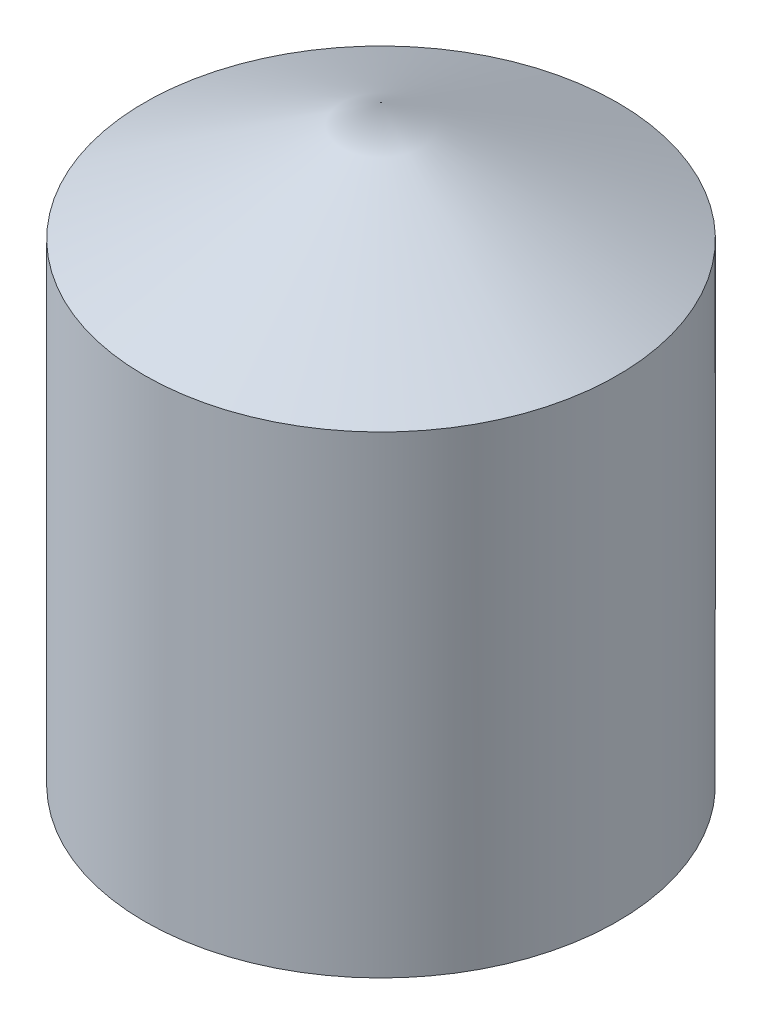
ISO-10303-21;
HEADER;
FILE_DESCRIPTION(('STEP AP214'),'2;1');
FILE_NAME('part.step','',(''),(''),'','','');
FILE_SCHEMA(('AUTOMOTIVE_DESIGN { 1 0 10303 214 1 1 1 1 }'));
ENDSEC;
DATA;
#1=APPLICATION_CONTEXT('core data for automotive mechanical design processes');
#2=APPLICATION_PROTOCOL_DEFINITION('international standard','automotive_design',2000,#1);
#3=PRODUCT_CONTEXT('',#1,'mechanical');
#4=PRODUCT('Part','Part','',(#3));
#5=PRODUCT_RELATED_PRODUCT_CATEGORY('part','',(#4));
#6=PRODUCT_DEFINITION_FORMATION('','',#4);
#7=PRODUCT_DEFINITION_CONTEXT('part definition',#1,'design');
#8=PRODUCT_DEFINITION('design','',#6,#7);
#9=PRODUCT_DEFINITION_SHAPE('','',#8);
#10=(LENGTH_UNIT() NAMED_UNIT(*) SI_UNIT(.MILLI.,.METRE.));
#11=(NAMED_UNIT(*) PLANE_ANGLE_UNIT() SI_UNIT($,.RADIAN.));
#12=(NAMED_UNIT(*) SI_UNIT($,.STERADIAN.) SOLID_ANGLE_UNIT());
#13=UNCERTAINTY_MEASURE_WITH_UNIT(LENGTH_MEASURE(1.E-05),#10,'distance_accuracy_value','');
#14=(GEOMETRIC_REPRESENTATION_CONTEXT(3) GLOBAL_UNCERTAINTY_ASSIGNED_CONTEXT((#13)) GLOBAL_UNIT_ASSIGNED_CONTEXT((#10,
#11,#12)) REPRESENTATION_CONTEXT('',''));
#15=CARTESIAN_POINT('',(0.,0.,0.));
#16=DIRECTION('',(0.,0.,1.));
#17=DIRECTION('',(1.,0.,0.));
#18=AXIS2_PLACEMENT_3D('',#15,#16,#17);
#19=CARTESIAN_POINT('',(0.,50.8,0.));
#20=DIRECTION('',(0.,-1.,0.));
#21=DIRECTION('',(0.,0.,-1.));
#22=AXIS2_PLACEMENT_3D('',#19,#20,#21);
#23=CYLINDRICAL_SURFACE('',#22,25.4);
#24=CARTESIAN_POINT('',(0.,50.8,0.));
#25=DIRECTION('',(0.,1.,0.));
#26=DIRECTION('',(0.,0.,1.));
#27=AXIS2_PLACEMENT_3D('',#24,#25,#26);
#28=CIRCLE('',#27,25.4);
#29=CARTESIAN_POINT('',(0.,50.8,25.4));
#30=VERTEX_POINT('',#29);
#31=EDGE_CURVE('E11',#30,#30,#28,.T.);
#32=ORIENTED_EDGE('',*,*,#31,.F.);
#33=EDGE_LOOP('',(#32));
#34=FACE_BOUND('',#33,.T.);
#35=CARTESIAN_POINT('',(0.,0.,0.));
#36=DIRECTION('',(0.,1.,0.));
#37=DIRECTION('',(0.,0.,1.));
#38=AXIS2_PLACEMENT_3D('',#35,#36,#37);
#39=CIRCLE('',#38,25.4);
#40=CARTESIAN_POINT('',(0.,0.,25.4));
#41=VERTEX_POINT('',#40);
#42=EDGE_CURVE('E42',#41,#41,#39,.T.);
#43=ORIENTED_EDGE('',*,*,#42,.T.);
#44=EDGE_LOOP('',(#43));
#45=FACE_BOUND('',#44,.T.);
#46=ADVANCED_FACE('F39',(#34,#45),#23,.T.);
#47=CARTESIAN_POINT('',(0.,0.,0.));
#48=DIRECTION('',(0.,1.,0.));
#49=DIRECTION('',(0.,0.,1.));
#50=AXIS2_PLACEMENT_3D('',#47,#48,#49);
#51=PLANE('',#50);
#52=ORIENTED_EDGE('',*,*,#42,.F.);
#53=EDGE_LOOP('',(#52));
#54=FACE_BOUND('',#53,.T.);
#55=ADVANCED_FACE('F51',(#54),#51,.F.);
#56=CARTESIAN_POINT('',(0.,50.8,0.));
#57=DIRECTION('',(0.,-1.,0.));
#58=DIRECTION('',(0.,0.,-1.));
#59=AXIS2_PLACEMENT_3D('',#56,#57,#58);
#60=CONICAL_SURFACE('',#59,25.4,1.10714871779409);
#61=CARTESIAN_POINT('',(0.,63.5,0.));
#62=VERTEX_POINT('',#61);
#63=VERTEX_LOOP('',#62);
#64=FACE_BOUND('',#63,.T.);
#65=ORIENTED_EDGE('',*,*,#31,.T.);
#66=EDGE_LOOP('',(#65));
#67=FACE_BOUND('',#66,.T.);
#68=ADVANCED_FACE('F48',(#64,#67),#60,.T.);
#69=CLOSED_SHELL('',(#46,#55,#68));
#70=MANIFOLD_SOLID_BREP('B2',#69);
#71=ADVANCED_BREP_SHAPE_REPRESENTATION('',(#18,#70),#14);
#72=SHAPE_DEFINITION_REPRESENTATION(#9,#71);
ENDSEC;
END-ISO-10303-21;
